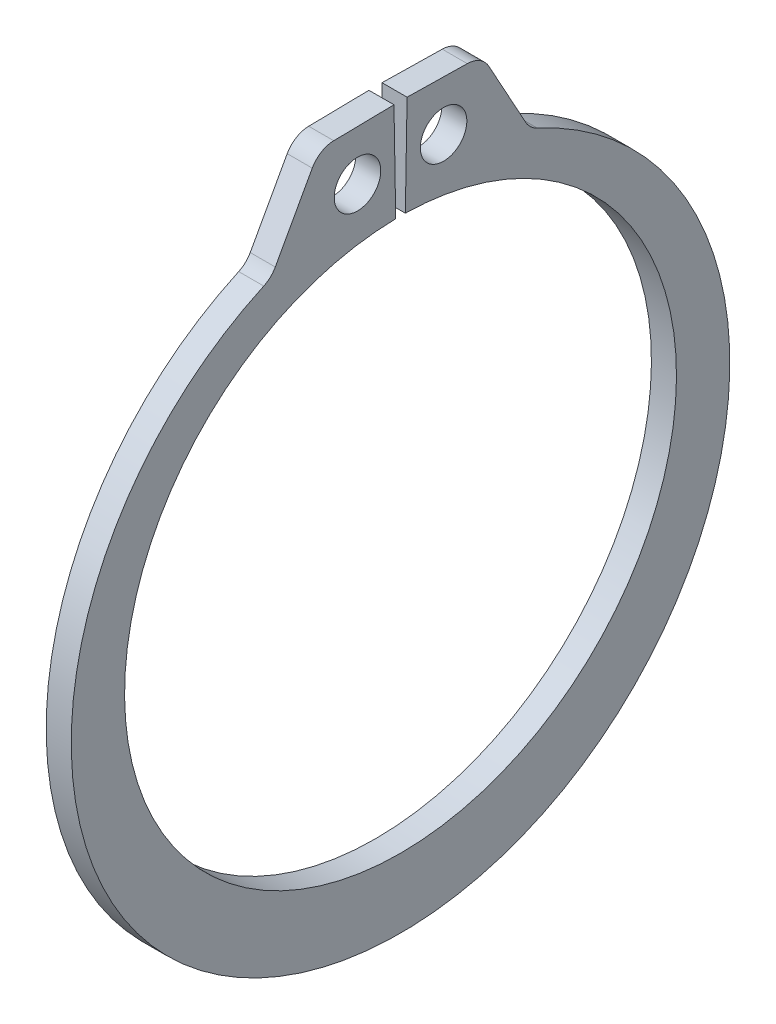
ISO-10303-21;
HEADER;
FILE_DESCRIPTION(('STEP AP214'),'2;1');
FILE_NAME('part.step','',(''),(''),'','','');
FILE_SCHEMA(('AUTOMOTIVE_DESIGN { 1 0 10303 214 1 1 1 1 }'));
ENDSEC;
DATA;
#1=APPLICATION_CONTEXT('core data for automotive mechanical design processes');
#2=APPLICATION_PROTOCOL_DEFINITION('international standard','automotive_design',2000,#1);
#3=PRODUCT_CONTEXT('',#1,'mechanical');
#4=PRODUCT('Part','Part','',(#3));
#5=PRODUCT_RELATED_PRODUCT_CATEGORY('part','',(#4));
#6=PRODUCT_DEFINITION_FORMATION('','',#4);
#7=PRODUCT_DEFINITION_CONTEXT('part definition',#1,'design');
#8=PRODUCT_DEFINITION('design','',#6,#7);
#9=PRODUCT_DEFINITION_SHAPE('','',#8);
#10=(LENGTH_UNIT() NAMED_UNIT(*) SI_UNIT(.MILLI.,.METRE.));
#11=(NAMED_UNIT(*) PLANE_ANGLE_UNIT() SI_UNIT($,.RADIAN.));
#12=(NAMED_UNIT(*) SI_UNIT($,.STERADIAN.) SOLID_ANGLE_UNIT());
#13=UNCERTAINTY_MEASURE_WITH_UNIT(LENGTH_MEASURE(1.E-05),#10,'distance_accuracy_value','');
#14=(GEOMETRIC_REPRESENTATION_CONTEXT(3) GLOBAL_UNCERTAINTY_ASSIGNED_CONTEXT((#13)) GLOBAL_UNIT_ASSIGNED_CONTEXT((#10,
#11,#12)) REPRESENTATION_CONTEXT('',''));
#15=CARTESIAN_POINT('',(0.,0.,0.));
#16=DIRECTION('',(0.,0.,1.));
#17=DIRECTION('',(1.,0.,0.));
#18=AXIS2_PLACEMENT_3D('',#15,#16,#17);
#19=CARTESIAN_POINT('',(0.5334,0.,0.));
#20=DIRECTION('',(1.,0.,0.));
#21=DIRECTION('',(0.,0.,-1.));
#22=AXIS2_PLACEMENT_3D('',#19,#20,#21);
#23=PLANE('',#22);
#24=CARTESIAN_POINT('',(0.5334,13.8385266688973,1.83246968592772));
#25=DIRECTION('',(1.,0.,0.));
#26=DIRECTION('',(0.,0.,-1.));
#27=AXIS2_PLACEMENT_3D('',#24,#25,#26);
#28=CIRCLE('',#27,0.9906);
#29=CARTESIAN_POINT('',(0.5334,13.8385266688973,0.841869685927715));
#30=VERTEX_POINT('',#29);
#31=EDGE_CURVE('E221',#30,#30,#28,.T.);
#32=ORIENTED_EDGE('',*,*,#31,.F.);
#33=EDGE_LOOP('',(#32));
#34=FACE_BOUND('',#33,.T.);
#35=DIRECTION('',(0.,-0.017452406437284,0.999847695156391));
#36=VECTOR('',#35,1.);
#37=CARTESIAN_POINT('',(0.5334,15.9868647521641,0.279051762247659));
#38=LINE('',#37,#36);
#39=CARTESIAN_POINT('',(0.5334,15.9868647521641,0.279051762247659));
#40=VERTEX_POINT('',#39);
#41=CARTESIAN_POINT('',(0.5334,15.9421290049668,2.84196100270575));
#42=VERTEX_POINT('',#41);
#43=EDGE_CURVE('E133',#40,#42,#38,.T.);
#44=ORIENTED_EDGE('',*,*,#43,.T.);
#45=CARTESIAN_POINT('',(0.5334,14.8754914837739,2.82334277551846));
#46=DIRECTION('',(1.,0.,0.));
#47=DIRECTION('',(0.,0.,-1.));
#48=AXIS2_PLACEMENT_3D('',#45,#46,#47);
#49=CIRCLE('',#48,1.0668);
#50=CARTESIAN_POINT('',(0.5334,15.3898880284944,3.75793275769226));
#51=VERTEX_POINT('',#50);
#52=EDGE_CURVE('E174',#42,#51,#49,.T.);
#53=ORIENTED_EDGE('',*,*,#52,.T.);
#54=DIRECTION('',(0.,-0.876068599712977,0.48218648736453));
#55=VECTOR('',#54,1.);
#56=CARTESIAN_POINT('',(0.5334,15.9313425389448,3.45991722723344));
#57=LINE('',#56,#55);
#58=CARTESIAN_POINT('',(0.5334,12.5308854181649,5.33152234473196));
#59=VERTEX_POINT('',#58);
#60=EDGE_CURVE('E213',#51,#59,#57,.T.);
#61=ORIENTED_EDGE('',*,*,#60,.T.);
#62=CARTESIAN_POINT('',(0.5334,13.0452819628854,6.26611232690577));
#63=DIRECTION('',(1.,0.,0.));
#64=DIRECTION('',(0.,0.,-1.));
#65=AXIS2_PLACEMENT_3D('',#62,#63,#64);
#66=CIRCLE('',#65,1.0668);
#67=CARTESIAN_POINT('',(0.5334,12.0748793383379,5.82296338324089));
#68=VERTEX_POINT('',#67);
#69=EDGE_CURVE('E181',#59,#68,#66,.F.);
#70=ORIENTED_EDGE('',*,*,#69,.T.);
#71=CARTESIAN_POINT('',(0.5334,-0.676181068147732,0.));
#72=DIRECTION('',(1.,0.,0.));
#73=DIRECTION('',(0.,0.,-1.));
#74=AXIS2_PLACEMENT_3D('',#71,#72,#73);
#75=CIRCLE('',#74,14.0177189318523);
#76=CARTESIAN_POINT('',(0.5334,12.0748793383379,-5.8229633832409));
#77=VERTEX_POINT('',#76);
#78=EDGE_CURVE('E206',#68,#77,#75,.T.);
#79=ORIENTED_EDGE('',*,*,#78,.T.);
#80=CARTESIAN_POINT('',(0.5334,13.0452819628854,-6.26611232690577));
#81=DIRECTION('',(1.,0.,0.));
#82=DIRECTION('',(0.,0.,-1.));
#83=AXIS2_PLACEMENT_3D('',#80,#81,#82);
#84=CIRCLE('',#83,1.0668);
#85=CARTESIAN_POINT('',(0.5334,12.5308854181649,-5.33152234473196));
#86=VERTEX_POINT('',#85);
#87=EDGE_CURVE('E11',#77,#86,#84,.F.);
#88=ORIENTED_EDGE('',*,*,#87,.T.);
#89=DIRECTION('',(0.,0.876068599712977,0.48218648736453));
#90=VECTOR('',#89,1.);
#91=CARTESIAN_POINT('',(0.5334,15.9313425389448,-3.45991722723344));
#92=LINE('',#91,#90);
#93=CARTESIAN_POINT('',(0.5334,15.3898880284944,-3.75793275769226));
#94=VERTEX_POINT('',#93);
#95=EDGE_CURVE('E205',#86,#94,#92,.T.);
#96=ORIENTED_EDGE('',*,*,#95,.T.);
#97=CARTESIAN_POINT('',(0.5334,14.8754914837739,-2.82334277551846));
#98=DIRECTION('',(1.,0.,0.));
#99=DIRECTION('',(0.,0.,-1.));
#100=AXIS2_PLACEMENT_3D('',#97,#98,#99);
#101=CIRCLE('',#100,1.0668);
#102=CARTESIAN_POINT('',(0.5334,15.9421290049668,-2.84196100270575));
#103=VERTEX_POINT('',#102);
#104=EDGE_CURVE('E49',#94,#103,#101,.T.);
#105=ORIENTED_EDGE('',*,*,#104,.T.);
#106=DIRECTION('',(0.,0.017452406437284,0.999847695156391));
#107=VECTOR('',#106,1.);
#108=CARTESIAN_POINT('',(0.5334,15.9868647521641,-0.279051762247659));
#109=LINE('',#108,#107);
#110=CARTESIAN_POINT('',(0.5334,15.9868647521641,-0.279051762247659));
#111=VERTEX_POINT('',#110);
#112=EDGE_CURVE('E210',#103,#111,#109,.T.);
#113=ORIENTED_EDGE('',*,*,#112,.T.);
#114=DIRECTION('',(0.,-0.999847695156391,0.0174524064372836));
#115=VECTOR('',#114,1.);
#116=CARTESIAN_POINT('',(0.5334,11.7457107988497,-0.205022144621989));
#117=LINE('',#116,#115);
#118=CARTESIAN_POINT('',(0.5334,11.7457107988497,-0.205022144621989));
#119=VERTEX_POINT('',#118);
#120=EDGE_CURVE('E139',#111,#119,#117,.T.);
#121=ORIENTED_EDGE('',*,*,#120,.T.);
#122=CARTESIAN_POINT('',(0.5334,0.,0.));
#123=DIRECTION('',(-1.,0.,0.));
#124=DIRECTION('',(0.,0.,-1.));
#125=AXIS2_PLACEMENT_3D('',#122,#123,#124);
#126=CIRCLE('',#125,11.7475);
#127=CARTESIAN_POINT('',(0.5334,11.7457107988497,0.205022144621989));
#128=VERTEX_POINT('',#127);
#129=EDGE_CURVE('E134',#119,#128,#126,.T.);
#130=ORIENTED_EDGE('',*,*,#129,.T.);
#131=DIRECTION('',(0.,0.999847695156391,0.0174524064372836));
#132=VECTOR('',#131,1.);
#133=CARTESIAN_POINT('',(0.5334,11.7457107988497,0.205022144621989));
#134=LINE('',#133,#132);
#135=EDGE_CURVE('E125',#128,#40,#134,.T.);
#136=ORIENTED_EDGE('',*,*,#135,.T.);
#137=EDGE_LOOP('',(#44,#53,#61,#70,#79,#88,#96,#105,#113,#121,#130,#136));
#138=FACE_BOUND('',#137,.T.);
#139=CARTESIAN_POINT('',(0.5334,13.8385266688973,-1.83246968592772));
#140=DIRECTION('',(1.,0.,0.));
#141=DIRECTION('',(0.,0.,-1.));
#142=AXIS2_PLACEMENT_3D('',#139,#140,#141);
#143=CIRCLE('',#142,0.9906);
#144=CARTESIAN_POINT('',(0.5334,13.8385266688973,-2.82306968592772));
#145=VERTEX_POINT('',#144);
#146=EDGE_CURVE('E247',#145,#145,#143,.T.);
#147=ORIENTED_EDGE('',*,*,#146,.F.);
#148=EDGE_LOOP('',(#147));
#149=FACE_BOUND('',#148,.T.);
#150=ADVANCED_FACE('F34',(#34,#138,#149),#23,.T.);
#151=CARTESIAN_POINT('',(-0.5334,0.,0.));
#152=DIRECTION('',(1.,0.,0.));
#153=DIRECTION('',(0.,0.,-1.));
#154=AXIS2_PLACEMENT_3D('',#151,#152,#153);
#155=PLANE('',#154);
#156=CARTESIAN_POINT('',(-0.5334,13.8385266688973,1.83246968592772));
#157=DIRECTION('',(1.,0.,0.));
#158=DIRECTION('',(0.,0.,-1.));
#159=AXIS2_PLACEMENT_3D('',#156,#157,#158);
#160=CIRCLE('',#159,0.9906);
#161=CARTESIAN_POINT('',(-0.5334,13.8385266688973,0.841869685927715));
#162=VERTEX_POINT('',#161);
#163=EDGE_CURVE('E244',#162,#162,#160,.T.);
#164=ORIENTED_EDGE('',*,*,#163,.T.);
#165=EDGE_LOOP('',(#164));
#166=FACE_BOUND('',#165,.T.);
#167=DIRECTION('',(0.,-0.876068599712977,0.48218648736453));
#168=VECTOR('',#167,1.);
#169=CARTESIAN_POINT('',(-0.5334,15.9313425389448,3.45991722723344));
#170=LINE('',#169,#168);
#171=CARTESIAN_POINT('',(-0.5334,15.3898880284944,3.75793275769226));
#172=VERTEX_POINT('',#171);
#173=CARTESIAN_POINT('',(-0.5334,12.5308854181649,5.33152234473196));
#174=VERTEX_POINT('',#173);
#175=EDGE_CURVE('E200',#172,#174,#170,.T.);
#176=ORIENTED_EDGE('',*,*,#175,.F.);
#177=CARTESIAN_POINT('',(-0.5334,14.8754914837739,2.82334277551846));
#178=DIRECTION('',(1.,0.,0.));
#179=DIRECTION('',(0.,0.,-1.));
#180=AXIS2_PLACEMENT_3D('',#177,#178,#179);
#181=CIRCLE('',#180,1.0668);
#182=CARTESIAN_POINT('',(-0.5334,15.9421290049668,2.84196100270575));
#183=VERTEX_POINT('',#182);
#184=EDGE_CURVE('E170',#172,#183,#181,.F.);
#185=ORIENTED_EDGE('',*,*,#184,.T.);
#186=DIRECTION('',(0.,-0.017452406437284,0.999847695156391));
#187=VECTOR('',#186,1.);
#188=CARTESIAN_POINT('',(-0.5334,15.9868647521641,0.279051762247659));
#189=LINE('',#188,#187);
#190=CARTESIAN_POINT('',(-0.5334,15.9868647521641,0.279051762247659));
#191=VERTEX_POINT('',#190);
#192=EDGE_CURVE('E223',#191,#183,#189,.T.);
#193=ORIENTED_EDGE('',*,*,#192,.F.);
#194=DIRECTION('',(0.,0.999847695156391,0.0174524064372836));
#195=VECTOR('',#194,1.);
#196=CARTESIAN_POINT('',(-0.5334,11.7457107988497,0.205022144621989));
#197=LINE('',#196,#195);
#198=CARTESIAN_POINT('',(-0.5334,11.7457107988497,0.205022144621989));
#199=VERTEX_POINT('',#198);
#200=EDGE_CURVE('E220',#199,#191,#197,.T.);
#201=ORIENTED_EDGE('',*,*,#200,.F.);
#202=CARTESIAN_POINT('',(-0.5334,0.,0.));
#203=DIRECTION('',(-1.,0.,0.));
#204=DIRECTION('',(0.,0.,-1.));
#205=AXIS2_PLACEMENT_3D('',#202,#203,#204);
#206=CIRCLE('',#205,11.7475);
#207=CARTESIAN_POINT('',(-0.5334,11.7457107988497,-0.205022144621989));
#208=VERTEX_POINT('',#207);
#209=EDGE_CURVE('E147',#208,#199,#206,.T.);
#210=ORIENTED_EDGE('',*,*,#209,.F.);
#211=DIRECTION('',(0.,-0.999847695156391,0.0174524064372836));
#212=VECTOR('',#211,1.);
#213=CARTESIAN_POINT('',(-0.5334,11.7457107988497,-0.205022144621989));
#214=LINE('',#213,#212);
#215=CARTESIAN_POINT('',(-0.5334,15.9868647521641,-0.279051762247659));
#216=VERTEX_POINT('',#215);
#217=EDGE_CURVE('E143',#216,#208,#214,.T.);
#218=ORIENTED_EDGE('',*,*,#217,.F.);
#219=DIRECTION('',(0.,0.017452406437284,0.999847695156391));
#220=VECTOR('',#219,1.);
#221=CARTESIAN_POINT('',(-0.5334,15.9868647521641,-0.279051762247659));
#222=LINE('',#221,#220);
#223=CARTESIAN_POINT('',(-0.5334,15.9421290049668,-2.84196100270575));
#224=VERTEX_POINT('',#223);
#225=EDGE_CURVE('E228',#224,#216,#222,.T.);
#226=ORIENTED_EDGE('',*,*,#225,.F.);
#227=CARTESIAN_POINT('',(-0.5334,14.8754914837739,-2.82334277551846));
#228=DIRECTION('',(1.,0.,0.));
#229=DIRECTION('',(0.,0.,-1.));
#230=AXIS2_PLACEMENT_3D('',#227,#228,#229);
#231=CIRCLE('',#230,1.0668);
#232=CARTESIAN_POINT('',(-0.5334,15.3898880284944,-3.75793275769226));
#233=VERTEX_POINT('',#232);
#234=EDGE_CURVE('E168',#224,#233,#231,.F.);
#235=ORIENTED_EDGE('',*,*,#234,.T.);
#236=DIRECTION('',(0.,0.876068599712977,0.48218648736453));
#237=VECTOR('',#236,1.);
#238=CARTESIAN_POINT('',(-0.5334,15.9313425389448,-3.45991722723344));
#239=LINE('',#238,#237);
#240=CARTESIAN_POINT('',(-0.5334,12.5308854181649,-5.33152234473196));
#241=VERTEX_POINT('',#240);
#242=EDGE_CURVE('E191',#241,#233,#239,.T.);
#243=ORIENTED_EDGE('',*,*,#242,.F.);
#244=CARTESIAN_POINT('',(-0.5334,13.0452819628854,-6.26611232690577));
#245=DIRECTION('',(1.,0.,0.));
#246=DIRECTION('',(0.,0.,-1.));
#247=AXIS2_PLACEMENT_3D('',#244,#245,#246);
#248=CIRCLE('',#247,1.0668);
#249=CARTESIAN_POINT('',(-0.5334,12.0748793383379,-5.8229633832409));
#250=VERTEX_POINT('',#249);
#251=EDGE_CURVE('E42',#241,#250,#248,.T.);
#252=ORIENTED_EDGE('',*,*,#251,.T.);
#253=CARTESIAN_POINT('',(-0.5334,-0.676181068147732,0.));
#254=DIRECTION('',(1.,0.,0.));
#255=DIRECTION('',(0.,0.,-1.));
#256=AXIS2_PLACEMENT_3D('',#253,#254,#255);
#257=CIRCLE('',#256,14.0177189318523);
#258=CARTESIAN_POINT('',(-0.5334,12.0748793383379,5.82296338324089));
#259=VERTEX_POINT('',#258);
#260=EDGE_CURVE('E189',#259,#250,#257,.T.);
#261=ORIENTED_EDGE('',*,*,#260,.F.);
#262=CARTESIAN_POINT('',(-0.5334,13.0452819628854,6.26611232690577));
#263=DIRECTION('',(1.,0.,0.));
#264=DIRECTION('',(0.,0.,-1.));
#265=AXIS2_PLACEMENT_3D('',#262,#263,#264);
#266=CIRCLE('',#265,1.0668);
#267=EDGE_CURVE('E179',#259,#174,#266,.T.);
#268=ORIENTED_EDGE('',*,*,#267,.T.);
#269=EDGE_LOOP('',(#176,#185,#193,#201,#210,#218,#226,#235,#243,#252,#261,#268));
#270=FACE_BOUND('',#269,.T.);
#271=CARTESIAN_POINT('',(-0.5334,13.8385266688973,-1.83246968592772));
#272=DIRECTION('',(1.,0.,0.));
#273=DIRECTION('',(0.,0.,-1.));
#274=AXIS2_PLACEMENT_3D('',#271,#272,#273);
#275=CIRCLE('',#274,0.9906);
#276=CARTESIAN_POINT('',(-0.5334,13.8385266688973,-2.82306968592772));
#277=VERTEX_POINT('',#276);
#278=EDGE_CURVE('E250',#277,#277,#275,.T.);
#279=ORIENTED_EDGE('',*,*,#278,.T.);
#280=EDGE_LOOP('',(#279));
#281=FACE_BOUND('',#280,.T.);
#282=ADVANCED_FACE('F187',(#166,#270,#281),#155,.F.);
#283=CARTESIAN_POINT('',(0.5334,0.,0.));
#284=DIRECTION('',(-1.,0.,0.));
#285=DIRECTION('',(0.,0.,1.));
#286=AXIS2_PLACEMENT_3D('',#283,#284,#285);
#287=CYLINDRICAL_SURFACE('',#286,11.7475);
#288=ORIENTED_EDGE('',*,*,#209,.T.);
#289=DIRECTION('',(-1.,0.,0.));
#290=VECTOR('',#289,1.);
#291=CARTESIAN_POINT('',(0.5334,11.7457107988497,0.205022144621989));
#292=LINE('',#291,#290);
#293=EDGE_CURVE('E129',#128,#199,#292,.T.);
#294=ORIENTED_EDGE('',*,*,#293,.F.);
#295=ORIENTED_EDGE('',*,*,#129,.F.);
#296=DIRECTION('',(-1.,0.,0.));
#297=VECTOR('',#296,1.);
#298=CARTESIAN_POINT('',(0.5334,11.7457107988497,-0.205022144621989));
#299=LINE('',#298,#297);
#300=EDGE_CURVE('E218',#119,#208,#299,.T.);
#301=ORIENTED_EDGE('',*,*,#300,.T.);
#302=EDGE_LOOP('',(#288,#294,#295,#301));
#303=FACE_BOUND('',#302,.T.);
#304=ADVANCED_FACE('F145',(#303),#287,.F.);
#305=CARTESIAN_POINT('',(0.5334,11.7457107988497,0.205022144621989));
#306=DIRECTION('',(0.,-0.0174524064372836,0.999847695156391));
#307=DIRECTION('',(0.,-0.999847695156391,-0.0174524064372836));
#308=AXIS2_PLACEMENT_3D('',#305,#306,#307);
#309=PLANE('',#308);
#310=ORIENTED_EDGE('',*,*,#200,.T.);
#311=DIRECTION('',(-1.,0.,0.));
#312=VECTOR('',#311,1.);
#313=CARTESIAN_POINT('',(0.5334,15.9868647521641,0.279051762247659));
#314=LINE('',#313,#312);
#315=EDGE_CURVE('E132',#40,#191,#314,.T.);
#316=ORIENTED_EDGE('',*,*,#315,.F.);
#317=ORIENTED_EDGE('',*,*,#135,.F.);
#318=ORIENTED_EDGE('',*,*,#293,.T.);
#319=EDGE_LOOP('',(#310,#316,#317,#318));
#320=FACE_BOUND('',#319,.T.);
#321=ADVANCED_FACE('F127',(#320),#309,.F.);
#322=CARTESIAN_POINT('',(0.5334,15.9868647521641,0.279051762247659));
#323=DIRECTION('',(0.,-0.999847695156391,-0.017452406437284));
#324=DIRECTION('',(0.,0.017452406437284,-0.999847695156391));
#325=AXIS2_PLACEMENT_3D('',#322,#323,#324);
#326=PLANE('',#325);
#327=ORIENTED_EDGE('',*,*,#192,.T.);
#328=DIRECTION('',(-1.,0.,0.));
#329=VECTOR('',#328,1.);
#330=CARTESIAN_POINT('',(0.5334,15.9421290049668,2.84196100270575));
#331=LINE('',#330,#329);
#332=EDGE_CURVE('E57',#183,#42,#331,.F.);
#333=ORIENTED_EDGE('',*,*,#332,.T.);
#334=ORIENTED_EDGE('',*,*,#43,.F.);
#335=ORIENTED_EDGE('',*,*,#315,.T.);
#336=EDGE_LOOP('',(#327,#333,#334,#335));
#337=FACE_BOUND('',#336,.T.);
#338=ADVANCED_FACE('F239',(#337),#326,.F.);
#339=CARTESIAN_POINT('',(0.5334,15.9313425389448,3.45991722723344));
#340=DIRECTION('',(0.,-0.48218648736453,-0.876068599712977));
#341=DIRECTION('',(0.,0.876068599712977,-0.48218648736453));
#342=AXIS2_PLACEMENT_3D('',#339,#340,#341);
#343=PLANE('',#342);
#344=ORIENTED_EDGE('',*,*,#175,.T.);
#345=DIRECTION('',(1.,0.,0.));
#346=VECTOR('',#345,1.);
#347=CARTESIAN_POINT('',(0.5334,12.5308854181649,5.33152234473196));
#348=LINE('',#347,#346);
#349=EDGE_CURVE('E161',#174,#59,#348,.T.);
#350=ORIENTED_EDGE('',*,*,#349,.T.);
#351=ORIENTED_EDGE('',*,*,#60,.F.);
#352=DIRECTION('',(-1.,0.,0.));
#353=VECTOR('',#352,1.);
#354=CARTESIAN_POINT('',(0.5334,15.3898880284944,3.75793275769226));
#355=LINE('',#354,#353);
#356=EDGE_CURVE('E158',#51,#172,#355,.T.);
#357=ORIENTED_EDGE('',*,*,#356,.T.);
#358=EDGE_LOOP('',(#344,#350,#351,#357));
#359=FACE_BOUND('',#358,.T.);
#360=ADVANCED_FACE('F280',(#359),#343,.F.);
#361=CARTESIAN_POINT('',(0.5334,-0.676181068147732,0.));
#362=DIRECTION('',(-1.,0.,0.));
#363=DIRECTION('',(0.,0.,1.));
#364=AXIS2_PLACEMENT_3D('',#361,#362,#363);
#365=CYLINDRICAL_SURFACE('',#364,14.0177189318523);
#366=ORIENTED_EDGE('',*,*,#78,.F.);
#367=DIRECTION('',(-1.,0.,0.));
#368=VECTOR('',#367,1.);
#369=CARTESIAN_POINT('',(0.5334,12.0748793383379,5.8229633832409));
#370=LINE('',#369,#368);
#371=EDGE_CURVE('E150',#68,#259,#370,.T.);
#372=ORIENTED_EDGE('',*,*,#371,.T.);
#373=ORIENTED_EDGE('',*,*,#260,.T.);
#374=DIRECTION('',(-1.,0.,0.));
#375=VECTOR('',#374,1.);
#376=CARTESIAN_POINT('',(0.5334,12.0748793383379,-5.8229633832409));
#377=LINE('',#376,#375);
#378=EDGE_CURVE('E148',#250,#77,#377,.F.);
#379=ORIENTED_EDGE('',*,*,#378,.T.);
#380=EDGE_LOOP('',(#366,#372,#373,#379));
#381=FACE_BOUND('',#380,.T.);
#382=ADVANCED_FACE('F197',(#381),#365,.T.);
#383=CARTESIAN_POINT('',(0.5334,15.9313425389448,-3.45991722723344));
#384=DIRECTION('',(0.,-0.48218648736453,0.876068599712977));
#385=DIRECTION('',(0.,-0.876068599712977,-0.48218648736453));
#386=AXIS2_PLACEMENT_3D('',#383,#384,#385);
#387=PLANE('',#386);
#388=ORIENTED_EDGE('',*,*,#95,.F.);
#389=DIRECTION('',(1.,0.,0.));
#390=VECTOR('',#389,1.);
#391=CARTESIAN_POINT('',(-0.5334,12.5308854181649,-5.33152234473196));
#392=LINE('',#391,#390);
#393=EDGE_CURVE('E165',#86,#241,#392,.F.);
#394=ORIENTED_EDGE('',*,*,#393,.T.);
#395=ORIENTED_EDGE('',*,*,#242,.T.);
#396=DIRECTION('',(-1.,0.,0.));
#397=VECTOR('',#396,1.);
#398=CARTESIAN_POINT('',(0.5334,15.3898880284944,-3.75793275769226));
#399=LINE('',#398,#397);
#400=EDGE_CURVE('E163',#233,#94,#399,.F.);
#401=ORIENTED_EDGE('',*,*,#400,.T.);
#402=EDGE_LOOP('',(#388,#394,#395,#401));
#403=FACE_BOUND('',#402,.T.);
#404=ADVANCED_FACE('F208',(#403),#387,.F.);
#405=CARTESIAN_POINT('',(0.5334,15.9868647521641,-0.279051762247659));
#406=DIRECTION('',(0.,-0.999847695156391,0.017452406437284));
#407=DIRECTION('',(0.,-0.017452406437284,-0.999847695156391));
#408=AXIS2_PLACEMENT_3D('',#405,#406,#407);
#409=PLANE('',#408);
#410=ORIENTED_EDGE('',*,*,#112,.F.);
#411=DIRECTION('',(-1.,0.,0.));
#412=VECTOR('',#411,1.);
#413=CARTESIAN_POINT('',(0.5334,15.9421290049668,-2.84196100270575));
#414=LINE('',#413,#412);
#415=EDGE_CURVE('E176',#103,#224,#414,.T.);
#416=ORIENTED_EDGE('',*,*,#415,.T.);
#417=ORIENTED_EDGE('',*,*,#225,.T.);
#418=DIRECTION('',(-1.,0.,0.));
#419=VECTOR('',#418,1.);
#420=CARTESIAN_POINT('',(0.5334,15.9868647521641,-0.279051762247659));
#421=LINE('',#420,#419);
#422=EDGE_CURVE('E152',#111,#216,#421,.T.);
#423=ORIENTED_EDGE('',*,*,#422,.F.);
#424=EDGE_LOOP('',(#410,#416,#417,#423));
#425=FACE_BOUND('',#424,.T.);
#426=ADVANCED_FACE('F273',(#425),#409,.F.);
#427=CARTESIAN_POINT('',(0.5334,11.7457107988497,-0.205022144621989));
#428=DIRECTION('',(0.,-0.0174524064372836,-0.999847695156391));
#429=DIRECTION('',(0.,0.999847695156391,-0.0174524064372836));
#430=AXIS2_PLACEMENT_3D('',#427,#428,#429);
#431=PLANE('',#430);
#432=ORIENTED_EDGE('',*,*,#217,.T.);
#433=ORIENTED_EDGE('',*,*,#300,.F.);
#434=ORIENTED_EDGE('',*,*,#120,.F.);
#435=ORIENTED_EDGE('',*,*,#422,.T.);
#436=EDGE_LOOP('',(#432,#433,#434,#435));
#437=FACE_BOUND('',#436,.T.);
#438=ADVANCED_FACE('F235',(#437),#431,.F.);
#439=CARTESIAN_POINT('',(0.5334,13.8385266688973,1.83246968592772));
#440=DIRECTION('',(-1.,0.,0.));
#441=DIRECTION('',(0.,0.,1.));
#442=AXIS2_PLACEMENT_3D('',#439,#440,#441);
#443=CYLINDRICAL_SURFACE('',#442,0.9906);
#444=ORIENTED_EDGE('',*,*,#31,.T.);
#445=EDGE_LOOP('',(#444));
#446=FACE_BOUND('',#445,.T.);
#447=ORIENTED_EDGE('',*,*,#163,.F.);
#448=EDGE_LOOP('',(#447));
#449=FACE_BOUND('',#448,.T.);
#450=ADVANCED_FACE('F268',(#446,#449),#443,.F.);
#451=CARTESIAN_POINT('',(0.5334,13.8385266688973,-1.83246968592772));
#452=DIRECTION('',(-1.,0.,0.));
#453=DIRECTION('',(0.,0.,1.));
#454=AXIS2_PLACEMENT_3D('',#451,#452,#453);
#455=CYLINDRICAL_SURFACE('',#454,0.9906);
#456=ORIENTED_EDGE('',*,*,#146,.T.);
#457=EDGE_LOOP('',(#456));
#458=FACE_BOUND('',#457,.T.);
#459=ORIENTED_EDGE('',*,*,#278,.F.);
#460=EDGE_LOOP('',(#459));
#461=FACE_BOUND('',#460,.T.);
#462=ADVANCED_FACE('F256',(#458,#461),#455,.F.);
#463=CARTESIAN_POINT('',(0.5334,13.0452819628854,6.26611232690577));
#464=DIRECTION('',(-1.,0.,0.));
#465=DIRECTION('',(0.,0.,1.));
#466=AXIS2_PLACEMENT_3D('',#463,#464,#465);
#467=CYLINDRICAL_SURFACE('',#466,1.0668);
#468=ORIENTED_EDGE('',*,*,#69,.F.);
#469=ORIENTED_EDGE('',*,*,#349,.F.);
#470=ORIENTED_EDGE('',*,*,#267,.F.);
#471=ORIENTED_EDGE('',*,*,#371,.F.);
#472=EDGE_LOOP('',(#468,#469,#470,#471));
#473=FACE_BOUND('',#472,.T.);
#474=ADVANCED_FACE('F290',(#473),#467,.F.);
#475=CARTESIAN_POINT('',(0.5334,13.0452819628854,-6.26611232690577));
#476=DIRECTION('',(-1.,0.,0.));
#477=DIRECTION('',(0.,0.,1.));
#478=AXIS2_PLACEMENT_3D('',#475,#476,#477);
#479=CYLINDRICAL_SURFACE('',#478,1.0668);
#480=ORIENTED_EDGE('',*,*,#87,.F.);
#481=ORIENTED_EDGE('',*,*,#378,.F.);
#482=ORIENTED_EDGE('',*,*,#251,.F.);
#483=ORIENTED_EDGE('',*,*,#393,.F.);
#484=EDGE_LOOP('',(#480,#481,#482,#483));
#485=FACE_BOUND('',#484,.T.);
#486=ADVANCED_FACE('F203',(#485),#479,.F.);
#487=CARTESIAN_POINT('',(0.5334,14.8754914837739,2.82334277551846));
#488=DIRECTION('',(-1.,0.,0.));
#489=DIRECTION('',(0.,0.,1.));
#490=AXIS2_PLACEMENT_3D('',#487,#488,#489);
#491=CYLINDRICAL_SURFACE('',#490,1.0668);
#492=ORIENTED_EDGE('',*,*,#52,.F.);
#493=ORIENTED_EDGE('',*,*,#332,.F.);
#494=ORIENTED_EDGE('',*,*,#184,.F.);
#495=ORIENTED_EDGE('',*,*,#356,.F.);
#496=EDGE_LOOP('',(#492,#493,#494,#495));
#497=FACE_BOUND('',#496,.T.);
#498=ADVANCED_FACE('F295',(#497),#491,.T.);
#499=CARTESIAN_POINT('',(0.5334,14.8754914837739,-2.82334277551846));
#500=DIRECTION('',(-1.,0.,0.));
#501=DIRECTION('',(0.,0.,1.));
#502=AXIS2_PLACEMENT_3D('',#499,#500,#501);
#503=CYLINDRICAL_SURFACE('',#502,1.0668);
#504=ORIENTED_EDGE('',*,*,#104,.F.);
#505=ORIENTED_EDGE('',*,*,#400,.F.);
#506=ORIENTED_EDGE('',*,*,#234,.F.);
#507=ORIENTED_EDGE('',*,*,#415,.F.);
#508=EDGE_LOOP('',(#504,#505,#506,#507));
#509=FACE_BOUND('',#508,.T.);
#510=ADVANCED_FACE('F36',(#509),#503,.T.);
#511=CLOSED_SHELL('',(#150,#282,#304,#321,#338,#360,#382,#404,#426,#438,#450,#462,#474,#486,
#498,#510));
#512=MANIFOLD_SOLID_BREP('B2',#511);
#513=ADVANCED_BREP_SHAPE_REPRESENTATION('',(#18,#512),#14);
#514=SHAPE_DEFINITION_REPRESENTATION(#9,#513);
ENDSEC;
END-ISO-10303-21;
